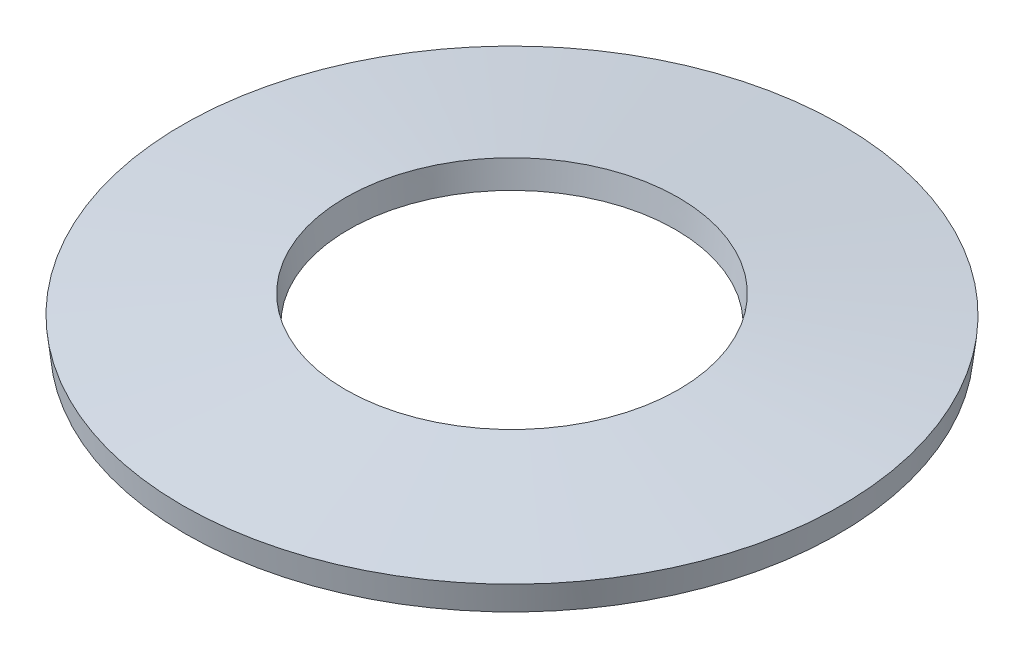
ISO-10303-21;
HEADER;
FILE_DESCRIPTION(('STEP AP214'),'2;1');
FILE_NAME('part.step','',(''),(''),'','','');
FILE_SCHEMA(('AUTOMOTIVE_DESIGN { 1 0 10303 214 1 1 1 1 }'));
ENDSEC;
DATA;
#1=APPLICATION_CONTEXT('core data for automotive mechanical design processes');
#2=APPLICATION_PROTOCOL_DEFINITION('international standard','automotive_design',2000,#1);
#3=PRODUCT_CONTEXT('',#1,'mechanical');
#4=PRODUCT('Part','Part','',(#3));
#5=PRODUCT_RELATED_PRODUCT_CATEGORY('part','',(#4));
#6=PRODUCT_DEFINITION_FORMATION('','',#4);
#7=PRODUCT_DEFINITION_CONTEXT('part definition',#1,'design');
#8=PRODUCT_DEFINITION('design','',#6,#7);
#9=PRODUCT_DEFINITION_SHAPE('','',#8);
#10=(LENGTH_UNIT() NAMED_UNIT(*) SI_UNIT(.MILLI.,.METRE.));
#11=(NAMED_UNIT(*) PLANE_ANGLE_UNIT() SI_UNIT($,.RADIAN.));
#12=(NAMED_UNIT(*) SI_UNIT($,.STERADIAN.) SOLID_ANGLE_UNIT());
#13=UNCERTAINTY_MEASURE_WITH_UNIT(LENGTH_MEASURE(1.E-05),#10,'distance_accuracy_value','');
#14=(GEOMETRIC_REPRESENTATION_CONTEXT(3) GLOBAL_UNCERTAINTY_ASSIGNED_CONTEXT((#13)) GLOBAL_UNIT_ASSIGNED_CONTEXT((#10,
#11,#12)) REPRESENTATION_CONTEXT('',''));
#15=CARTESIAN_POINT('',(0.,0.,0.));
#16=DIRECTION('',(0.,0.,1.));
#17=DIRECTION('',(1.,0.,0.));
#18=AXIS2_PLACEMENT_3D('',#15,#16,#17);
#19=CARTESIAN_POINT('',(0.,-0.0353228402,0.));
#20=DIRECTION('',(0.,-1.,0.));
#21=DIRECTION('',(0.,0.,-1.));
#22=AXIS2_PLACEMENT_3D('',#19,#20,#21);
#23=CONICAL_SURFACE('',#22,6.5025996694,1.45709635342253);
#24=CARTESIAN_POINT('',(0.,0.3532284528,0.));
#25=DIRECTION('',(0.,1.,0.));
#26=DIRECTION('',(0.,0.,1.));
#27=AXIS2_PLACEMENT_3D('',#24,#25,#26);
#28=CIRCLE('',#27,3.0999999976);
#29=CARTESIAN_POINT('',(0.,0.3532284528,3.0999999976));
#30=VERTEX_POINT('',#29);
#31=EDGE_CURVE('E18',#30,#30,#28,.T.);
#32=ORIENTED_EDGE('',*,*,#31,.T.);
#33=EDGE_LOOP('',(#32));
#34=FACE_BOUND('',#33,.T.);
#35=CARTESIAN_POINT('',(0.,0.,0.));
#36=DIRECTION('',(0.,1.,0.));
#37=DIRECTION('',(0.,0.,1.));
#38=AXIS2_PLACEMENT_3D('',#35,#36,#37);
#39=CIRCLE('',#38,6.1932724242);
#40=CARTESIAN_POINT('',(0.,0.,6.1932724242));
#41=VERTEX_POINT('',#40);
#42=EDGE_CURVE('E27',#41,#41,#39,.T.);
#43=ORIENTED_EDGE('',*,*,#42,.F.);
#44=EDGE_LOOP('',(#43));
#45=FACE_BOUND('',#44,.T.);
#46=ADVANCED_FACE('F14',(#34,#45),#23,.F.);
#47=CARTESIAN_POINT('',(0.,0.899677144,0.));
#48=DIRECTION('',(0.,1.,0.));
#49=DIRECTION('',(0.,0.,1.));
#50=AXIS2_PLACEMENT_3D('',#47,#48,#49);
#51=CONICAL_SURFACE('',#50,3.16240033,0.113699976037774);
#52=ORIENTED_EDGE('',*,*,#31,.F.);
#53=EDGE_LOOP('',(#52));
#54=FACE_BOUND('',#53,.T.);
#55=CARTESIAN_POINT('',(0.,0.8500000018,0.));
#56=DIRECTION('',(0.,-1.,0.));
#57=DIRECTION('',(0.,0.,-1.));
#58=AXIS2_PLACEMENT_3D('',#55,#56,#57);
#59=CIRCLE('',#58,3.1567275702);
#60=CARTESIAN_POINT('',(0.,0.8500000018,-3.1567275702));
#61=VERTEX_POINT('',#60);
#62=EDGE_CURVE('E22',#61,#61,#59,.T.);
#63=ORIENTED_EDGE('',*,*,#62,.F.);
#64=EDGE_LOOP('',(#63));
#65=FACE_BOUND('',#64,.T.);
#66=ADVANCED_FACE('F37',(#54,#65),#51,.F.);
#67=CARTESIAN_POINT('',(0.,0.5464487166,0.));
#68=DIRECTION('',(0.,1.,0.));
#69=DIRECTION('',(0.,0.,1.));
#70=AXIS2_PLACEMENT_3D('',#67,#68,#69);
#71=CONICAL_SURFACE('',#70,6.2556727566,0.113699970798209);
#72=CARTESIAN_POINT('',(0.,0.496771553653505,0.));
#73=DIRECTION('',(0.,1.,0.));
#74=DIRECTION('',(0.,0.,1.));
#75=AXIS2_PLACEMENT_3D('',#72,#73,#74);
#76=CIRCLE('',#75,6.24999999879976);
#77=CARTESIAN_POINT('',(0.,0.496771553653505,6.24999999879976));
#78=VERTEX_POINT('',#77);
#79=EDGE_CURVE('E10',#78,#78,#76,.T.);
#80=ORIENTED_EDGE('',*,*,#79,.F.);
#81=EDGE_LOOP('',(#80));
#82=FACE_BOUND('',#81,.T.);
#83=ORIENTED_EDGE('',*,*,#42,.T.);
#84=EDGE_LOOP('',(#83));
#85=FACE_BOUND('',#84,.T.);
#86=ADVANCED_FACE('F40',(#82,#85),#71,.T.);
#87=CARTESIAN_POINT('',(0.,0.4614487088,0.));
#88=DIRECTION('',(0.,-1.,0.));
#89=DIRECTION('',(0.,0.,-1.));
#90=AXIS2_PLACEMENT_3D('',#87,#88,#89);
#91=CONICAL_SURFACE('',#90,6.559327242,1.45709635342253);
#92=ORIENTED_EDGE('',*,*,#79,.T.);
#93=EDGE_LOOP('',(#92));
#94=FACE_BOUND('',#93,.T.);
#95=ORIENTED_EDGE('',*,*,#62,.T.);
#96=EDGE_LOOP('',(#95));
#97=FACE_BOUND('',#96,.T.);
#98=ADVANCED_FACE('F16',(#94,#97),#91,.T.);
#99=CLOSED_SHELL('',(#46,#66,#86,#98));
#100=MANIFOLD_SOLID_BREP('B1',#99);
#101=ADVANCED_BREP_SHAPE_REPRESENTATION('',(#18,#100),#14);
#102=SHAPE_DEFINITION_REPRESENTATION(#9,#101);
ENDSEC;
END-ISO-10303-21;
